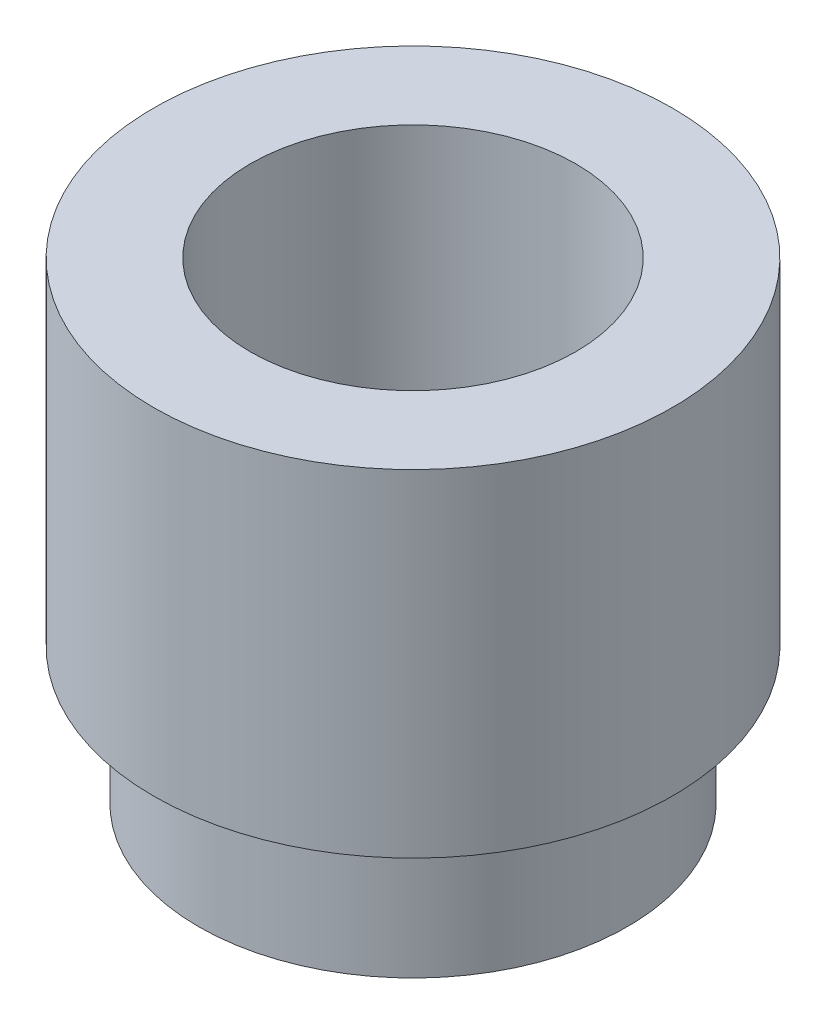
ISO-10303-21;
HEADER;
FILE_DESCRIPTION(('STEP AP214'),'2;1');
FILE_NAME('part.step','',(''),(''),'','','');
FILE_SCHEMA(('AUTOMOTIVE_DESIGN { 1 0 10303 214 1 1 1 1 }'));
ENDSEC;
DATA;
#1=APPLICATION_CONTEXT('core data for automotive mechanical design processes');
#2=APPLICATION_PROTOCOL_DEFINITION('international standard','automotive_design',2000,#1);
#3=PRODUCT_CONTEXT('',#1,'mechanical');
#4=PRODUCT('Part','Part','',(#3));
#5=PRODUCT_RELATED_PRODUCT_CATEGORY('part','',(#4));
#6=PRODUCT_DEFINITION_FORMATION('','',#4);
#7=PRODUCT_DEFINITION_CONTEXT('part definition',#1,'design');
#8=PRODUCT_DEFINITION('design','',#6,#7);
#9=PRODUCT_DEFINITION_SHAPE('','',#8);
#10=(LENGTH_UNIT() NAMED_UNIT(*) SI_UNIT(.MILLI.,.METRE.));
#11=(NAMED_UNIT(*) PLANE_ANGLE_UNIT() SI_UNIT($,.RADIAN.));
#12=(NAMED_UNIT(*) SI_UNIT($,.STERADIAN.) SOLID_ANGLE_UNIT());
#13=UNCERTAINTY_MEASURE_WITH_UNIT(LENGTH_MEASURE(1.E-05),#10,'distance_accuracy_value','');
#14=(GEOMETRIC_REPRESENTATION_CONTEXT(3) GLOBAL_UNCERTAINTY_ASSIGNED_CONTEXT((#13)) GLOBAL_UNIT_ASSIGNED_CONTEXT((#10,
#11,#12)) REPRESENTATION_CONTEXT('',''));
#15=CARTESIAN_POINT('',(0.,0.,0.));
#16=DIRECTION('',(0.,0.,1.));
#17=DIRECTION('',(1.,0.,0.));
#18=AXIS2_PLACEMENT_3D('',#15,#16,#17);
#19=CARTESIAN_POINT('',(0.,0.,0.));
#20=DIRECTION('',(0.,-1.,0.));
#21=DIRECTION('',(0.,0.,-1.));
#22=AXIS2_PLACEMENT_3D('',#19,#20,#21);
#23=CYLINDRICAL_SURFACE('',#22,1.5);
#24=CARTESIAN_POINT('',(0.,0.,0.));
#25=DIRECTION('',(0.,-1.,0.));
#26=DIRECTION('',(0.,0.,-1.));
#27=AXIS2_PLACEMENT_3D('',#24,#25,#26);
#28=CIRCLE('',#27,1.5);
#29=CARTESIAN_POINT('',(0.,0.,-1.5));
#30=VERTEX_POINT('',#29);
#31=EDGE_CURVE('E53',#30,#30,#28,.T.);
#32=ORIENTED_EDGE('',*,*,#31,.T.);
#33=EDGE_LOOP('',(#32));
#34=FACE_BOUND('',#33,.T.);
#35=CARTESIAN_POINT('',(0.,4.35,0.));
#36=DIRECTION('',(0.,-1.,0.));
#37=DIRECTION('',(0.,0.,-1.));
#38=AXIS2_PLACEMENT_3D('',#35,#36,#37);
#39=CIRCLE('',#38,1.5);
#40=CARTESIAN_POINT('',(0.,4.35,-1.5));
#41=VERTEX_POINT('',#40);
#42=EDGE_CURVE('E10',#41,#41,#39,.T.);
#43=ORIENTED_EDGE('',*,*,#42,.F.);
#44=EDGE_LOOP('',(#43));
#45=FACE_BOUND('',#44,.T.);
#46=ADVANCED_FACE('F31',(#34,#45),#23,.F.);
#47=CARTESIAN_POINT('',(1.5,4.35,0.));
#48=DIRECTION('',(0.,1.,0.));
#49=DIRECTION('',(0.,0.,1.));
#50=AXIS2_PLACEMENT_3D('',#47,#48,#49);
#51=PLANE('',#50);
#52=ORIENTED_EDGE('',*,*,#42,.T.);
#53=EDGE_LOOP('',(#52));
#54=FACE_BOUND('',#53,.T.);
#55=CARTESIAN_POINT('',(0.,4.35,0.));
#56=DIRECTION('',(0.,-1.,0.));
#57=DIRECTION('',(0.,0.,-1.));
#58=AXIS2_PLACEMENT_3D('',#55,#56,#57);
#59=CIRCLE('',#58,2.39);
#60=CARTESIAN_POINT('',(0.,4.35,-2.39));
#61=VERTEX_POINT('',#60);
#62=EDGE_CURVE('E37',#61,#61,#59,.T.);
#63=ORIENTED_EDGE('',*,*,#62,.F.);
#64=EDGE_LOOP('',(#63));
#65=FACE_BOUND('',#64,.T.);
#66=ADVANCED_FACE('F71',(#54,#65),#51,.T.);
#67=CARTESIAN_POINT('',(0.,0.,0.));
#68=DIRECTION('',(0.,-1.,0.));
#69=DIRECTION('',(0.,0.,-1.));
#70=AXIS2_PLACEMENT_3D('',#67,#68,#69);
#71=CYLINDRICAL_SURFACE('',#70,2.39);
#72=ORIENTED_EDGE('',*,*,#62,.T.);
#73=EDGE_LOOP('',(#72));
#74=FACE_BOUND('',#73,.T.);
#75=CARTESIAN_POINT('',(0.,1.25,0.));
#76=DIRECTION('',(0.,-1.,0.));
#77=DIRECTION('',(0.,0.,-1.));
#78=AXIS2_PLACEMENT_3D('',#75,#76,#77);
#79=CIRCLE('',#78,2.39);
#80=CARTESIAN_POINT('',(0.,1.25,-2.39));
#81=VERTEX_POINT('',#80);
#82=EDGE_CURVE('E41',#81,#81,#79,.T.);
#83=ORIENTED_EDGE('',*,*,#82,.F.);
#84=EDGE_LOOP('',(#83));
#85=FACE_BOUND('',#84,.T.);
#86=ADVANCED_FACE('F75',(#74,#85),#71,.T.);
#87=CARTESIAN_POINT('',(2.39,1.25,0.));
#88=DIRECTION('',(0.,-1.,0.));
#89=DIRECTION('',(0.,0.,-1.));
#90=AXIS2_PLACEMENT_3D('',#87,#88,#89);
#91=PLANE('',#90);
#92=ORIENTED_EDGE('',*,*,#82,.T.);
#93=EDGE_LOOP('',(#92));
#94=FACE_BOUND('',#93,.T.);
#95=CARTESIAN_POINT('',(0.,1.25,0.));
#96=DIRECTION('',(0.,-1.,0.));
#97=DIRECTION('',(0.,0.,-1.));
#98=AXIS2_PLACEMENT_3D('',#95,#96,#97);
#99=CIRCLE('',#98,1.975);
#100=CARTESIAN_POINT('',(0.,1.25,-1.975));
#101=VERTEX_POINT('',#100);
#102=EDGE_CURVE('E45',#101,#101,#99,.T.);
#103=ORIENTED_EDGE('',*,*,#102,.F.);
#104=EDGE_LOOP('',(#103));
#105=FACE_BOUND('',#104,.T.);
#106=ADVANCED_FACE('F67',(#94,#105),#91,.T.);
#107=CARTESIAN_POINT('',(0.,0.,0.));
#108=DIRECTION('',(0.,-1.,0.));
#109=DIRECTION('',(0.,0.,-1.));
#110=AXIS2_PLACEMENT_3D('',#107,#108,#109);
#111=CYLINDRICAL_SURFACE('',#110,1.975);
#112=ORIENTED_EDGE('',*,*,#102,.T.);
#113=EDGE_LOOP('',(#112));
#114=FACE_BOUND('',#113,.T.);
#115=CARTESIAN_POINT('',(0.,0.,0.));
#116=DIRECTION('',(0.,-1.,0.));
#117=DIRECTION('',(0.,0.,-1.));
#118=AXIS2_PLACEMENT_3D('',#115,#116,#117);
#119=CIRCLE('',#118,1.975);
#120=CARTESIAN_POINT('',(0.,0.,-1.975));
#121=VERTEX_POINT('',#120);
#122=EDGE_CURVE('E50',#121,#121,#119,.T.);
#123=ORIENTED_EDGE('',*,*,#122,.F.);
#124=EDGE_LOOP('',(#123));
#125=FACE_BOUND('',#124,.T.);
#126=ADVANCED_FACE('F61',(#114,#125),#111,.T.);
#127=CARTESIAN_POINT('',(1.975,0.,0.));
#128=DIRECTION('',(0.,-1.,0.));
#129=DIRECTION('',(0.,0.,-1.));
#130=AXIS2_PLACEMENT_3D('',#127,#128,#129);
#131=PLANE('',#130);
#132=ORIENTED_EDGE('',*,*,#122,.T.);
#133=EDGE_LOOP('',(#132));
#134=FACE_BOUND('',#133,.T.);
#135=ORIENTED_EDGE('',*,*,#31,.F.);
#136=EDGE_LOOP('',(#135));
#137=FACE_BOUND('',#136,.T.);
#138=ADVANCED_FACE('F59',(#134,#137),#131,.T.);
#139=CLOSED_SHELL('',(#46,#66,#86,#106,#126,#138));
#140=MANIFOLD_SOLID_BREP('B2',#139);
#141=ADVANCED_BREP_SHAPE_REPRESENTATION('',(#18,#140),#14);
#142=SHAPE_DEFINITION_REPRESENTATION(#9,#141);
ENDSEC;
END-ISO-10303-21;
